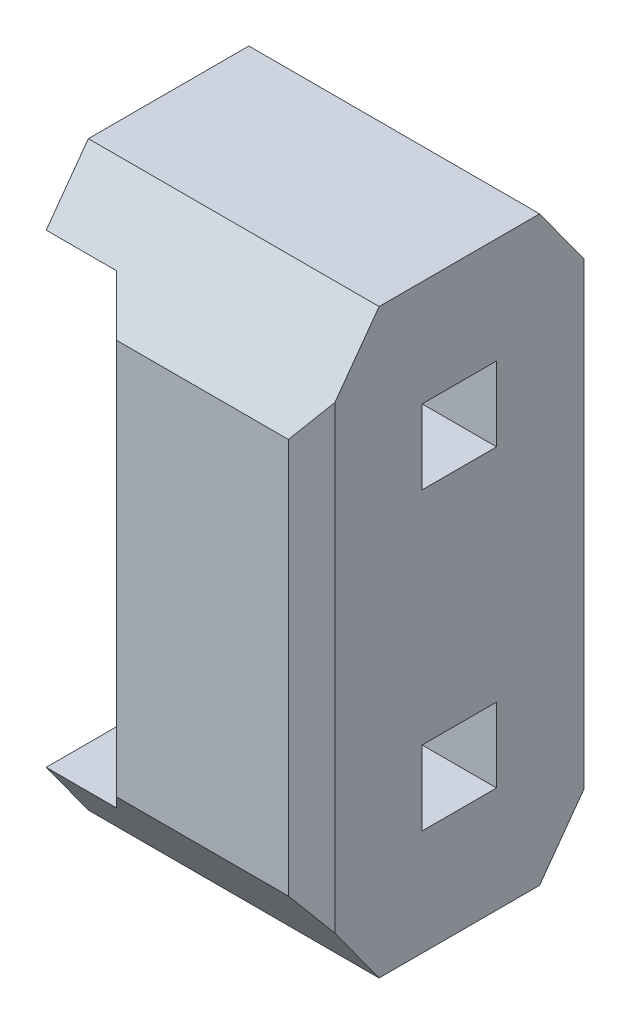
ISO-10303-21;
HEADER;
FILE_DESCRIPTION(('STEP AP214'),'2;1');
FILE_NAME('part.step','',(''),(''),'','','');
FILE_SCHEMA(('AUTOMOTIVE_DESIGN { 1 0 10303 214 1 1 1 1 }'));
ENDSEC;
DATA;
#1=APPLICATION_CONTEXT('core data for automotive mechanical design processes');
#2=APPLICATION_PROTOCOL_DEFINITION('international standard','automotive_design',2000,#1);
#3=PRODUCT_CONTEXT('',#1,'mechanical');
#4=PRODUCT('Part','Part','',(#3));
#5=PRODUCT_RELATED_PRODUCT_CATEGORY('part','',(#4));
#6=PRODUCT_DEFINITION_FORMATION('','',#4);
#7=PRODUCT_DEFINITION_CONTEXT('part definition',#1,'design');
#8=PRODUCT_DEFINITION('design','',#6,#7);
#9=PRODUCT_DEFINITION_SHAPE('','',#8);
#10=(LENGTH_UNIT() NAMED_UNIT(*) SI_UNIT(.MILLI.,.METRE.));
#11=(NAMED_UNIT(*) PLANE_ANGLE_UNIT() SI_UNIT($,.RADIAN.));
#12=(NAMED_UNIT(*) SI_UNIT($,.STERADIAN.) SOLID_ANGLE_UNIT());
#13=UNCERTAINTY_MEASURE_WITH_UNIT(LENGTH_MEASURE(1.E-05),#10,'distance_accuracy_value','');
#14=(GEOMETRIC_REPRESENTATION_CONTEXT(3) GLOBAL_UNCERTAINTY_ASSIGNED_CONTEXT((#13)) GLOBAL_UNIT_ASSIGNED_CONTEXT((#10,
#11,#12)) REPRESENTATION_CONTEXT('',''));
#15=CARTESIAN_POINT('',(0.,0.,0.));
#16=DIRECTION('',(0.,0.,1.));
#17=DIRECTION('',(1.,0.,0.));
#18=AXIS2_PLACEMENT_3D('',#15,#16,#17);
#19=CARTESIAN_POINT('',(1.25,4.6,-35.85));
#20=DIRECTION('',(0.,0.586967571460905,0.809610443394407));
#21=DIRECTION('',(0.,-0.809610443394407,0.586967571460905));
#22=AXIS2_PLACEMENT_3D('',#19,#20,#21);
#23=PLANE('',#22);
#24=DIRECTION('',(1.,0.,0.));
#25=VECTOR('',#24,1.);
#26=CARTESIAN_POINT('',(1.25,4.5,-35.7775));
#27=LINE('',#26,#25);
#28=CARTESIAN_POINT('',(0.,4.5,-35.7775));
#29=VERTEX_POINT('',#28);
#30=CARTESIAN_POINT('',(0.602500000000325,4.5,-35.7775000000001));
#31=VERTEX_POINT('',#30);
#32=EDGE_CURVE('E199',#29,#31,#27,.T.);
#33=ORIENTED_EDGE('',*,*,#32,.T.);
#34=DIRECTION('',(0.506207656348697,-0.698217457033984,0.506207656349602));
#35=VECTOR('',#34,1.);
#36=CARTESIAN_POINT('',(0.6025000000002,4.5,-35.7775));
#37=LINE('',#36,#35);
#38=CARTESIAN_POINT('',(0.819999999999671,4.2,-35.5599999999999));
#39=VERTEX_POINT('',#38);
#40=EDGE_CURVE('E197',#31,#39,#37,.T.);
#41=ORIENTED_EDGE('',*,*,#40,.T.);
#42=DIRECTION('',(1.,0.,0.));
#43=VECTOR('',#42,1.);
#44=CARTESIAN_POINT('',(1.25,4.19999999999999,-35.56));
#45=LINE('',#44,#43);
#46=CARTESIAN_POINT('',(2.30000000000012,4.2,-35.5599999999999));
#47=VERTEX_POINT('',#46);
#48=EDGE_CURVE('E20',#39,#47,#45,.T.);
#49=ORIENTED_EDGE('',*,*,#48,.T.);
#50=DIRECTION('',(0.506207656348957,0.698217457033858,-0.506207656349515));
#51=VECTOR('',#50,1.);
#52=CARTESIAN_POINT('',(2.3,4.19999999999999,-35.56));
#53=LINE('',#52,#51);
#54=CARTESIAN_POINT('',(2.49999999999988,4.47586206896592,-35.7600000000002));
#55=VERTEX_POINT('',#54);
#56=EDGE_CURVE('E181',#47,#55,#53,.T.);
#57=ORIENTED_EDGE('',*,*,#56,.T.);
#58=DIRECTION('',(0.,-0.809610443394407,0.586967571460905));
#59=VECTOR('',#58,1.);
#60=CARTESIAN_POINT('',(2.5,4.6,-35.85));
#61=LINE('',#60,#59);
#62=CARTESIAN_POINT('',(2.5,5.,-36.14));
#63=VERTEX_POINT('',#62);
#64=EDGE_CURVE('E188',#55,#63,#61,.F.);
#65=ORIENTED_EDGE('',*,*,#64,.T.);
#66=DIRECTION('',(1.,0.,0.));
#67=VECTOR('',#66,1.);
#68=CARTESIAN_POINT('',(1.25,5.,-36.14));
#69=LINE('',#68,#67);
#70=CARTESIAN_POINT('',(0.,5.,-36.14));
#71=VERTEX_POINT('',#70);
#72=EDGE_CURVE('E215',#71,#63,#69,.T.);
#73=ORIENTED_EDGE('',*,*,#72,.F.);
#74=DIRECTION('',(0.,-0.809610443394407,0.586967571460905));
#75=VECTOR('',#74,1.);
#76=CARTESIAN_POINT('',(0.,4.6,-35.85));
#77=LINE('',#76,#75);
#78=EDGE_CURVE('E207',#71,#29,#77,.T.);
#79=ORIENTED_EDGE('',*,*,#78,.T.);
#80=EDGE_LOOP('',(#33,#41,#49,#57,#65,#73,#79));
#81=FACE_BOUND('',#80,.T.);
#82=ADVANCED_FACE('F17',(#81),#23,.T.);
#83=CARTESIAN_POINT('',(1.25,4.6,-37.81));
#84=DIRECTION('',(0.,-0.586967571460905,0.809610443394407));
#85=DIRECTION('',(0.,-0.809610443394407,-0.586967571460905));
#86=AXIS2_PLACEMENT_3D('',#83,#84,#85);
#87=PLANE('',#86);
#88=DIRECTION('',(0.,-0.809610443394407,-0.586967571460905));
#89=VECTOR('',#88,1.);
#90=CARTESIAN_POINT('',(0.,4.6,-37.81));
#91=LINE('',#90,#89);
#92=CARTESIAN_POINT('',(0.,5.,-37.52));
#93=VERTEX_POINT('',#92);
#94=CARTESIAN_POINT('',(0.,4.5,-37.8825));
#95=VERTEX_POINT('',#94);
#96=EDGE_CURVE('E263',#93,#95,#91,.T.);
#97=ORIENTED_EDGE('',*,*,#96,.F.);
#98=DIRECTION('',(1.,0.,0.));
#99=VECTOR('',#98,1.);
#100=CARTESIAN_POINT('',(1.25,5.,-37.52));
#101=LINE('',#100,#99);
#102=CARTESIAN_POINT('',(2.5,5.,-37.52));
#103=VERTEX_POINT('',#102);
#104=EDGE_CURVE('E227',#103,#93,#101,.F.);
#105=ORIENTED_EDGE('',*,*,#104,.F.);
#106=DIRECTION('',(0.,-0.809610443394407,-0.586967571460905));
#107=VECTOR('',#106,1.);
#108=CARTESIAN_POINT('',(2.5,4.6,-37.81));
#109=LINE('',#108,#107);
#110=CARTESIAN_POINT('',(2.49999999999988,4.47586206896592,-37.8999999999998));
#111=VERTEX_POINT('',#110);
#112=EDGE_CURVE('E223',#111,#103,#109,.F.);
#113=ORIENTED_EDGE('',*,*,#112,.F.);
#114=DIRECTION('',(0.506207656348954,0.698217457033861,0.506207656349513));
#115=VECTOR('',#114,1.);
#116=CARTESIAN_POINT('',(2.3,4.19999999999999,-38.1));
#117=LINE('',#116,#115);
#118=CARTESIAN_POINT('',(2.30000000000012,4.2,-38.1000000000001));
#119=VERTEX_POINT('',#118);
#120=EDGE_CURVE('E266',#119,#111,#117,.T.);
#121=ORIENTED_EDGE('',*,*,#120,.F.);
#122=DIRECTION('',(1.,0.,0.));
#123=VECTOR('',#122,1.);
#124=CARTESIAN_POINT('',(1.25,4.19999999999999,-38.1));
#125=LINE('',#124,#123);
#126=CARTESIAN_POINT('',(0.819999999999671,4.2,-38.1000000000001));
#127=VERTEX_POINT('',#126);
#128=EDGE_CURVE('E205',#127,#119,#125,.T.);
#129=ORIENTED_EDGE('',*,*,#128,.F.);
#130=DIRECTION('',(0.506207656348697,-0.698217457033984,-0.506207656349602));
#131=VECTOR('',#130,1.);
#132=CARTESIAN_POINT('',(0.6025000000002,4.5,-37.8825));
#133=LINE('',#132,#131);
#134=CARTESIAN_POINT('',(0.602500000000324,4.5,-37.8824999999999));
#135=VERTEX_POINT('',#134);
#136=EDGE_CURVE('E203',#135,#127,#133,.T.);
#137=ORIENTED_EDGE('',*,*,#136,.F.);
#138=DIRECTION('',(1.,0.,0.));
#139=VECTOR('',#138,1.);
#140=CARTESIAN_POINT('',(1.25,4.5,-37.8825));
#141=LINE('',#140,#139);
#142=EDGE_CURVE('E261',#95,#135,#141,.T.);
#143=ORIENTED_EDGE('',*,*,#142,.F.);
#144=EDGE_LOOP('',(#97,#105,#113,#121,#129,#137,#143));
#145=FACE_BOUND('',#144,.T.);
#146=ADVANCED_FACE('F285',(#145),#87,.F.);
#147=CARTESIAN_POINT('',(1.25,0.4,-37.81));
#148=DIRECTION('',(0.,0.586967571460905,0.809610443394407));
#149=DIRECTION('',(0.,-0.809610443394407,0.586967571460905));
#150=AXIS2_PLACEMENT_3D('',#147,#148,#149);
#151=PLANE('',#150);
#152=DIRECTION('',(-0.5062076563494,0.698217457033649,-0.506207656349361));
#153=VECTOR('',#152,1.);
#154=CARTESIAN_POINT('',(2.5,0.524137931034493,-37.9));
#155=LINE('',#154,#153);
#156=CARTESIAN_POINT('',(2.49999999999988,0.524137931034496,-37.8999999999999));
#157=VERTEX_POINT('',#156);
#158=CARTESIAN_POINT('',(2.30000000000012,0.800000000000004,-38.1000000000001));
#159=VERTEX_POINT('',#158);
#160=EDGE_CURVE('E251',#157,#159,#155,.T.);
#161=ORIENTED_EDGE('',*,*,#160,.F.);
#162=DIRECTION('',(0.,-0.809610443394407,0.586967571460905));
#163=VECTOR('',#162,1.);
#164=CARTESIAN_POINT('',(2.5,0.4,-37.81));
#165=LINE('',#164,#163);
#166=CARTESIAN_POINT('',(2.5,0.,-37.52));
#167=VERTEX_POINT('',#166);
#168=EDGE_CURVE('E253',#167,#157,#165,.F.);
#169=ORIENTED_EDGE('',*,*,#168,.F.);
#170=DIRECTION('',(1.,0.,0.));
#171=VECTOR('',#170,1.);
#172=CARTESIAN_POINT('',(1.25,0.,-37.52));
#173=LINE('',#172,#171);
#174=CARTESIAN_POINT('',(0.,0.,-37.52));
#175=VERTEX_POINT('',#174);
#176=EDGE_CURVE('E288',#167,#175,#173,.F.);
#177=ORIENTED_EDGE('',*,*,#176,.T.);
#178=DIRECTION('',(0.,-0.809610443394407,0.586967571460905));
#179=VECTOR('',#178,1.);
#180=CARTESIAN_POINT('',(0.,0.4,-37.81));
#181=LINE('',#180,#179);
#182=CARTESIAN_POINT('',(0.,0.5,-37.8825));
#183=VERTEX_POINT('',#182);
#184=EDGE_CURVE('E255',#183,#175,#181,.T.);
#185=ORIENTED_EDGE('',*,*,#184,.F.);
#186=DIRECTION('',(1.,0.,0.));
#187=VECTOR('',#186,1.);
#188=CARTESIAN_POINT('',(1.25,0.500000000000001,-37.8825));
#189=LINE('',#188,#187);
#190=CARTESIAN_POINT('',(0.602500000000324,0.5,-37.8824999999999));
#191=VERTEX_POINT('',#190);
#192=EDGE_CURVE('E257',#191,#183,#189,.F.);
#193=ORIENTED_EDGE('',*,*,#192,.F.);
#194=DIRECTION('',(-0.506207656348696,-0.698217457033985,0.506207656349601));
#195=VECTOR('',#194,1.);
#196=CARTESIAN_POINT('',(0.8199999999998,0.800000000000008,-38.1));
#197=LINE('',#196,#195);
#198=CARTESIAN_POINT('',(0.819999999999671,0.800000000000004,-38.1000000000001));
#199=VERTEX_POINT('',#198);
#200=EDGE_CURVE('E259',#199,#191,#197,.T.);
#201=ORIENTED_EDGE('',*,*,#200,.F.);
#202=DIRECTION('',(1.,0.,0.));
#203=VECTOR('',#202,1.);
#204=CARTESIAN_POINT('',(1.25,0.800000000000008,-38.1));
#205=LINE('',#204,#203);
#206=EDGE_CURVE('E249',#159,#199,#205,.F.);
#207=ORIENTED_EDGE('',*,*,#206,.F.);
#208=EDGE_LOOP('',(#161,#169,#177,#185,#193,#201,#207));
#209=FACE_BOUND('',#208,.T.);
#210=ADVANCED_FACE('F431',(#209),#151,.F.);
#211=CARTESIAN_POINT('',(1.25,0.4,-35.85));
#212=DIRECTION('',(0.,-0.586967571460905,0.809610443394407));
#213=DIRECTION('',(0.,-0.809610443394407,-0.586967571460905));
#214=AXIS2_PLACEMENT_3D('',#211,#212,#213);
#215=PLANE('',#214);
#216=DIRECTION('',(1.,0.,0.));
#217=VECTOR('',#216,1.);
#218=CARTESIAN_POINT('',(1.25,0.800000000000008,-35.56));
#219=LINE('',#218,#217);
#220=CARTESIAN_POINT('',(2.30000000000012,0.800000000000004,-35.5599999999999));
#221=VERTEX_POINT('',#220);
#222=CARTESIAN_POINT('',(0.819999999999671,0.800000000000004,-35.5599999999999));
#223=VERTEX_POINT('',#222);
#224=EDGE_CURVE('E191',#221,#223,#219,.F.);
#225=ORIENTED_EDGE('',*,*,#224,.T.);
#226=DIRECTION('',(-0.506207656348696,-0.698217457033985,-0.506207656349601));
#227=VECTOR('',#226,1.);
#228=CARTESIAN_POINT('',(0.8199999999998,0.800000000000008,-35.56));
#229=LINE('',#228,#227);
#230=CARTESIAN_POINT('',(0.602500000000324,0.5,-35.7775000000001));
#231=VERTEX_POINT('',#230);
#232=EDGE_CURVE('E232',#223,#231,#229,.T.);
#233=ORIENTED_EDGE('',*,*,#232,.T.);
#234=DIRECTION('',(1.,0.,0.));
#235=VECTOR('',#234,1.);
#236=CARTESIAN_POINT('',(1.25,0.500000000000001,-35.7775));
#237=LINE('',#236,#235);
#238=CARTESIAN_POINT('',(0.,0.5,-35.7775));
#239=VERTEX_POINT('',#238);
#240=EDGE_CURVE('E246',#231,#239,#237,.F.);
#241=ORIENTED_EDGE('',*,*,#240,.T.);
#242=DIRECTION('',(0.,-0.809610443394407,-0.586967571460905));
#243=VECTOR('',#242,1.);
#244=CARTESIAN_POINT('',(0.,0.4,-35.85));
#245=LINE('',#244,#243);
#246=CARTESIAN_POINT('',(0.,0.,-36.14));
#247=VERTEX_POINT('',#246);
#248=EDGE_CURVE('E244',#239,#247,#245,.T.);
#249=ORIENTED_EDGE('',*,*,#248,.T.);
#250=DIRECTION('',(1.,0.,0.));
#251=VECTOR('',#250,1.);
#252=CARTESIAN_POINT('',(1.25,0.,-36.14));
#253=LINE('',#252,#251);
#254=CARTESIAN_POINT('',(2.5,0.,-36.14));
#255=VERTEX_POINT('',#254);
#256=EDGE_CURVE('E293',#247,#255,#253,.T.);
#257=ORIENTED_EDGE('',*,*,#256,.T.);
#258=DIRECTION('',(0.,-0.809610443394407,-0.586967571460905));
#259=VECTOR('',#258,1.);
#260=CARTESIAN_POINT('',(2.5,0.4,-35.85));
#261=LINE('',#260,#259);
#262=CARTESIAN_POINT('',(2.49999999999988,0.524137931034499,-35.7600000000001));
#263=VERTEX_POINT('',#262);
#264=EDGE_CURVE('E241',#255,#263,#261,.F.);
#265=ORIENTED_EDGE('',*,*,#264,.T.);
#266=DIRECTION('',(-0.506207656349409,0.698217457033648,0.506207656349353));
#267=VECTOR('',#266,1.);
#268=CARTESIAN_POINT('',(2.5,0.524137931034498,-35.76));
#269=LINE('',#268,#267);
#270=EDGE_CURVE('E239',#263,#221,#269,.T.);
#271=ORIENTED_EDGE('',*,*,#270,.T.);
#272=EDGE_LOOP('',(#225,#233,#241,#249,#257,#265,#271));
#273=FACE_BOUND('',#272,.T.);
#274=ADVANCED_FACE('F421',(#273),#215,.T.);
#275=CARTESIAN_POINT('',(1.25,5.,-36.83));
#276=DIRECTION('',(0.,1.,0.));
#277=DIRECTION('',(0.,0.,1.));
#278=AXIS2_PLACEMENT_3D('',#275,#276,#277);
#279=PLANE('',#278);
#280=ORIENTED_EDGE('',*,*,#104,.T.);
#281=DIRECTION('',(0.,0.,-1.));
#282=VECTOR('',#281,1.);
#283=CARTESIAN_POINT('',(0.,5.,-36.83));
#284=LINE('',#283,#282);
#285=EDGE_CURVE('E231',#93,#71,#284,.F.);
#286=ORIENTED_EDGE('',*,*,#285,.T.);
#287=ORIENTED_EDGE('',*,*,#72,.T.);
#288=DIRECTION('',(0.,0.,1.));
#289=VECTOR('',#288,1.);
#290=CARTESIAN_POINT('',(2.5,5.,-36.83));
#291=LINE('',#290,#289);
#292=EDGE_CURVE('E219',#63,#103,#291,.F.);
#293=ORIENTED_EDGE('',*,*,#292,.T.);
#294=EDGE_LOOP('',(#280,#286,#287,#293));
#295=FACE_BOUND('',#294,.T.);
#296=ADVANCED_FACE('F229',(#295),#279,.T.);
#297=CARTESIAN_POINT('',(1.25,0.,-36.83));
#298=DIRECTION('',(0.,1.,0.));
#299=DIRECTION('',(0.,0.,1.));
#300=AXIS2_PLACEMENT_3D('',#297,#298,#299);
#301=PLANE('',#300);
#302=DIRECTION('',(0.,0.,-1.));
#303=VECTOR('',#302,1.);
#304=CARTESIAN_POINT('',(0.,0.,-36.83));
#305=LINE('',#304,#303);
#306=EDGE_CURVE('E297',#247,#175,#305,.T.);
#307=ORIENTED_EDGE('',*,*,#306,.T.);
#308=ORIENTED_EDGE('',*,*,#176,.F.);
#309=DIRECTION('',(0.,0.,1.));
#310=VECTOR('',#309,1.);
#311=CARTESIAN_POINT('',(2.5,0.,-36.83));
#312=LINE('',#311,#310);
#313=EDGE_CURVE('E287',#255,#167,#312,.F.);
#314=ORIENTED_EDGE('',*,*,#313,.F.);
#315=ORIENTED_EDGE('',*,*,#256,.F.);
#316=EDGE_LOOP('',(#307,#308,#314,#315));
#317=FACE_BOUND('',#316,.T.);
#318=ADVANCED_FACE('F428',(#317),#301,.F.);
#319=CARTESIAN_POINT('',(0.,4.75,-36.83));
#320=DIRECTION('',(1.,0.,0.));
#321=DIRECTION('',(0.,0.,-1.));
#322=AXIS2_PLACEMENT_3D('',#319,#320,#321);
#323=PLANE('',#322);
#324=ORIENTED_EDGE('',*,*,#285,.F.);
#325=ORIENTED_EDGE('',*,*,#96,.T.);
#326=DIRECTION('',(0.,0.,1.));
#327=VECTOR('',#326,1.);
#328=CARTESIAN_POINT('',(0.,4.5,-36.83));
#329=LINE('',#328,#327);
#330=EDGE_CURVE('E307',#95,#29,#329,.T.);
#331=ORIENTED_EDGE('',*,*,#330,.T.);
#332=ORIENTED_EDGE('',*,*,#78,.F.);
#333=EDGE_LOOP('',(#324,#325,#331,#332));
#334=FACE_BOUND('',#333,.T.);
#335=ADVANCED_FACE('F441',(#334),#323,.F.);
#336=CARTESIAN_POINT('',(0.,0.25,-36.83));
#337=DIRECTION('',(1.,0.,0.));
#338=DIRECTION('',(0.,0.,-1.));
#339=AXIS2_PLACEMENT_3D('',#336,#337,#338);
#340=PLANE('',#339);
#341=ORIENTED_EDGE('',*,*,#306,.F.);
#342=ORIENTED_EDGE('',*,*,#248,.F.);
#343=DIRECTION('',(0.,0.,1.));
#344=VECTOR('',#343,1.);
#345=CARTESIAN_POINT('',(0.,0.5,-36.83));
#346=LINE('',#345,#344);
#347=EDGE_CURVE('E315',#183,#239,#346,.T.);
#348=ORIENTED_EDGE('',*,*,#347,.F.);
#349=ORIENTED_EDGE('',*,*,#184,.T.);
#350=EDGE_LOOP('',(#341,#342,#348,#349));
#351=FACE_BOUND('',#350,.T.);
#352=ADVANCED_FACE('F443',(#351),#340,.F.);
#353=CARTESIAN_POINT('',(1.55,3.45,-36.83));
#354=DIRECTION('',(0.,1.,0.));
#355=DIRECTION('',(0.,0.,1.));
#356=AXIS2_PLACEMENT_3D('',#353,#354,#355);
#357=PLANE('',#356);
#358=DIRECTION('',(1.,0.,0.));
#359=VECTOR('',#358,1.);
#360=CARTESIAN_POINT('',(1.55,3.45,-37.15));
#361=LINE('',#360,#359);
#362=CARTESIAN_POINT('',(0.6,3.45,-37.15));
#363=VERTEX_POINT('',#362);
#364=CARTESIAN_POINT('',(2.5,3.45,-37.15));
#365=VERTEX_POINT('',#364);
#366=EDGE_CURVE('E332',#363,#365,#361,.T.);
#367=ORIENTED_EDGE('',*,*,#366,.F.);
#368=DIRECTION('',(0.,0.,1.));
#369=VECTOR('',#368,1.);
#370=CARTESIAN_POINT('',(0.6,3.45,-36.83));
#371=LINE('',#370,#369);
#372=CARTESIAN_POINT('',(0.6,3.45,-36.51));
#373=VERTEX_POINT('',#372);
#374=EDGE_CURVE('E302',#363,#373,#371,.T.);
#375=ORIENTED_EDGE('',*,*,#374,.T.);
#376=DIRECTION('',(1.,0.,0.));
#377=VECTOR('',#376,1.);
#378=CARTESIAN_POINT('',(1.55,3.45,-36.51));
#379=LINE('',#378,#377);
#380=CARTESIAN_POINT('',(2.5,3.45,-36.51));
#381=VERTEX_POINT('',#380);
#382=EDGE_CURVE('E327',#373,#381,#379,.T.);
#383=ORIENTED_EDGE('',*,*,#382,.T.);
#384=DIRECTION('',(0.,0.,1.));
#385=VECTOR('',#384,1.);
#386=CARTESIAN_POINT('',(2.5,3.45,-36.83));
#387=LINE('',#386,#385);
#388=EDGE_CURVE('E300',#381,#365,#387,.F.);
#389=ORIENTED_EDGE('',*,*,#388,.T.);
#390=EDGE_LOOP('',(#367,#375,#383,#389));
#391=FACE_BOUND('',#390,.T.);
#392=ADVANCED_FACE('F398',(#391),#357,.T.);
#393=CARTESIAN_POINT('',(0.71,2.5,-37.99));
#394=DIRECTION('',(0.707106781190498,0.,0.707106781182598));
#395=DIRECTION('',(0.707106781182598,0.,-0.707106781190498));
#396=AXIS2_PLACEMENT_3D('',#393,#394,#395);
#397=PLANE('',#396);
#398=ORIENTED_EDGE('',*,*,#200,.T.);
#399=DIRECTION('',(0.707106781187161,0.,-0.707106781185934));
#400=VECTOR('',#399,1.);
#401=CARTESIAN_POINT('',(0.6000000000002,0.5,-37.88));
#402=LINE('',#401,#400);
#403=CARTESIAN_POINT('',(0.600000000000408,0.5,-37.8799999999997));
#404=VERTEX_POINT('',#403);
#405=EDGE_CURVE('E312',#404,#191,#402,.T.);
#406=ORIENTED_EDGE('',*,*,#405,.F.);
#407=DIRECTION('',(0.,1.,0.));
#408=VECTOR('',#407,1.);
#409=CARTESIAN_POINT('',(0.6,2.5,-37.88));
#410=LINE('',#409,#408);
#411=CARTESIAN_POINT('',(0.600000000000408,4.5,-37.8799999999997));
#412=VERTEX_POINT('',#411);
#413=EDGE_CURVE('E337',#404,#412,#410,.T.);
#414=ORIENTED_EDGE('',*,*,#413,.T.);
#415=DIRECTION('',(0.707106781187161,0.,-0.707106781185934));
#416=VECTOR('',#415,1.);
#417=CARTESIAN_POINT('',(0.6000000000002,4.5,-37.88));
#418=LINE('',#417,#416);
#419=EDGE_CURVE('E304',#412,#135,#418,.T.);
#420=ORIENTED_EDGE('',*,*,#419,.T.);
#421=ORIENTED_EDGE('',*,*,#136,.T.);
#422=DIRECTION('',(0.,1.,0.));
#423=VECTOR('',#422,1.);
#424=CARTESIAN_POINT('',(0.8199999999998,2.5,-38.1));
#425=LINE('',#424,#423);
#426=EDGE_CURVE('E275',#127,#199,#425,.F.);
#427=ORIENTED_EDGE('',*,*,#426,.T.);
#428=EDGE_LOOP('',(#398,#406,#414,#420,#421,#427));
#429=FACE_BOUND('',#428,.T.);
#430=ADVANCED_FACE('F435',(#429),#397,.F.);
#431=CARTESIAN_POINT('',(0.30125,4.5,-36.83));
#432=DIRECTION('',(0.,1.,0.));
#433=DIRECTION('',(0.,0.,1.));
#434=AXIS2_PLACEMENT_3D('',#431,#432,#433);
#435=PLANE('',#434);
#436=ORIENTED_EDGE('',*,*,#142,.T.);
#437=ORIENTED_EDGE('',*,*,#419,.F.);
#438=DIRECTION('',(0.,0.,-1.));
#439=VECTOR('',#438,1.);
#440=CARTESIAN_POINT('',(0.6,4.5,-36.83));
#441=LINE('',#440,#439);
#442=CARTESIAN_POINT('',(0.600000000000279,4.5,-35.7800000000001));
#443=VERTEX_POINT('',#442);
#444=EDGE_CURVE('E339',#412,#443,#441,.F.);
#445=ORIENTED_EDGE('',*,*,#444,.T.);
#446=DIRECTION('',(-0.707106781182598,0.,-0.707106781190498));
#447=VECTOR('',#446,1.);
#448=CARTESIAN_POINT('',(0.71,4.5,-35.67));
#449=LINE('',#448,#447);
#450=EDGE_CURVE('E310',#443,#31,#449,.F.);
#451=ORIENTED_EDGE('',*,*,#450,.T.);
#452=ORIENTED_EDGE('',*,*,#32,.F.);
#453=ORIENTED_EDGE('',*,*,#330,.F.);
#454=EDGE_LOOP('',(#436,#437,#445,#451,#452,#453));
#455=FACE_BOUND('',#454,.T.);
#456=ADVANCED_FACE('F439',(#455),#435,.F.);
#457=CARTESIAN_POINT('',(0.71,2.5,-35.67));
#458=DIRECTION('',(0.707106781190498,0.,-0.707106781182598));
#459=DIRECTION('',(-0.707106781182598,0.,-0.707106781190498));
#460=AXIS2_PLACEMENT_3D('',#457,#458,#459);
#461=PLANE('',#460);
#462=ORIENTED_EDGE('',*,*,#232,.F.);
#463=DIRECTION('',(0.,1.,0.));
#464=VECTOR('',#463,1.);
#465=CARTESIAN_POINT('',(0.8199999999998,2.5,-35.56));
#466=LINE('',#465,#464);
#467=EDGE_CURVE('E325',#39,#223,#466,.F.);
#468=ORIENTED_EDGE('',*,*,#467,.F.);
#469=ORIENTED_EDGE('',*,*,#40,.F.);
#470=ORIENTED_EDGE('',*,*,#450,.F.);
#471=DIRECTION('',(0.,1.,0.));
#472=VECTOR('',#471,1.);
#473=CARTESIAN_POINT('',(0.6,2.5,-35.78));
#474=LINE('',#473,#472);
#475=CARTESIAN_POINT('',(0.600000000000408,0.5,-35.7800000000003));
#476=VERTEX_POINT('',#475);
#477=EDGE_CURVE('E341',#443,#476,#474,.F.);
#478=ORIENTED_EDGE('',*,*,#477,.T.);
#479=DIRECTION('',(-0.707106781187161,0.,-0.707106781185934));
#480=VECTOR('',#479,1.);
#481=CARTESIAN_POINT('',(0.6025000000002,0.5,-35.7775));
#482=LINE('',#481,#480);
#483=EDGE_CURVE('E318',#231,#476,#482,.T.);
#484=ORIENTED_EDGE('',*,*,#483,.F.);
#485=EDGE_LOOP('',(#462,#468,#469,#470,#478,#484));
#486=FACE_BOUND('',#485,.T.);
#487=ADVANCED_FACE('F416',(#486),#461,.F.);
#488=CARTESIAN_POINT('',(0.30125,0.5,-36.83));
#489=DIRECTION('',(0.,1.,0.));
#490=DIRECTION('',(0.,0.,1.));
#491=AXIS2_PLACEMENT_3D('',#488,#489,#490);
#492=PLANE('',#491);
#493=ORIENTED_EDGE('',*,*,#483,.T.);
#494=DIRECTION('',(0.,0.,-1.));
#495=VECTOR('',#494,1.);
#496=CARTESIAN_POINT('',(0.6,0.5,-36.83));
#497=LINE('',#496,#495);
#498=EDGE_CURVE('E343',#476,#404,#497,.T.);
#499=ORIENTED_EDGE('',*,*,#498,.T.);
#500=ORIENTED_EDGE('',*,*,#405,.T.);
#501=ORIENTED_EDGE('',*,*,#192,.T.);
#502=ORIENTED_EDGE('',*,*,#347,.T.);
#503=ORIENTED_EDGE('',*,*,#240,.F.);
#504=EDGE_LOOP('',(#493,#499,#500,#501,#502,#503));
#505=FACE_BOUND('',#504,.T.);
#506=ADVANCED_FACE('F418',(#505),#492,.T.);
#507=CARTESIAN_POINT('',(1.55,1.23,-37.15));
#508=DIRECTION('',(0.,0.,1.));
#509=DIRECTION('',(1.,0.,0.));
#510=AXIS2_PLACEMENT_3D('',#507,#508,#509);
#511=PLANE('',#510);
#512=DIRECTION('',(1.,0.,0.));
#513=VECTOR('',#512,1.);
#514=CARTESIAN_POINT('',(1.55,1.55,-37.15));
#515=LINE('',#514,#513);
#516=CARTESIAN_POINT('',(2.5,1.55,-37.15));
#517=VERTEX_POINT('',#516);
#518=CARTESIAN_POINT('',(0.6,1.55,-37.15));
#519=VERTEX_POINT('',#518);
#520=EDGE_CURVE('E283',#517,#519,#515,.F.);
#521=ORIENTED_EDGE('',*,*,#520,.T.);
#522=DIRECTION('',(0.,1.,0.));
#523=VECTOR('',#522,1.);
#524=CARTESIAN_POINT('',(0.6,2.5,-37.15));
#525=LINE('',#524,#523);
#526=CARTESIAN_POINT('',(0.6,0.91,-37.15));
#527=VERTEX_POINT('',#526);
#528=EDGE_CURVE('E346',#519,#527,#525,.F.);
#529=ORIENTED_EDGE('',*,*,#528,.T.);
#530=DIRECTION('',(1.,0.,0.));
#531=VECTOR('',#530,1.);
#532=CARTESIAN_POINT('',(1.55,0.91,-37.15));
#533=LINE('',#532,#531);
#534=CARTESIAN_POINT('',(2.5,0.91,-37.15));
#535=VERTEX_POINT('',#534);
#536=EDGE_CURVE('E354',#535,#527,#533,.F.);
#537=ORIENTED_EDGE('',*,*,#536,.F.);
#538=DIRECTION('',(0.,1.,0.));
#539=VECTOR('',#538,1.);
#540=CARTESIAN_POINT('',(2.5,1.23,-37.15));
#541=LINE('',#540,#539);
#542=EDGE_CURVE('E321',#535,#517,#541,.T.);
#543=ORIENTED_EDGE('',*,*,#542,.T.);
#544=EDGE_LOOP('',(#521,#529,#537,#543));
#545=FACE_BOUND('',#544,.T.);
#546=ADVANCED_FACE('F483',(#545),#511,.T.);
#547=CARTESIAN_POINT('',(1.56,2.5,-38.1));
#548=DIRECTION('',(0.,0.,1.));
#549=DIRECTION('',(1.,0.,0.));
#550=AXIS2_PLACEMENT_3D('',#547,#548,#549);
#551=PLANE('',#550);
#552=DIRECTION('',(0.,1.,0.));
#553=VECTOR('',#552,1.);
#554=CARTESIAN_POINT('',(2.30000000000047,2.5,-38.1000000000005));
#555=LINE('',#554,#553);
#556=EDGE_CURVE('E193',#159,#119,#555,.T.);
#557=ORIENTED_EDGE('',*,*,#556,.F.);
#558=ORIENTED_EDGE('',*,*,#206,.T.);
#559=ORIENTED_EDGE('',*,*,#426,.F.);
#560=ORIENTED_EDGE('',*,*,#128,.T.);
#561=EDGE_LOOP('',(#557,#558,#559,#560));
#562=FACE_BOUND('',#561,.T.);
#563=ADVANCED_FACE('F272',(#562),#551,.F.);
#564=CARTESIAN_POINT('',(1.56,2.5,-35.56));
#565=DIRECTION('',(0.,0.,1.));
#566=DIRECTION('',(1.,0.,0.));
#567=AXIS2_PLACEMENT_3D('',#564,#565,#566);
#568=PLANE('',#567);
#569=ORIENTED_EDGE('',*,*,#48,.F.);
#570=ORIENTED_EDGE('',*,*,#467,.T.);
#571=ORIENTED_EDGE('',*,*,#224,.F.);
#572=DIRECTION('',(0.,1.,0.));
#573=VECTOR('',#572,1.);
#574=CARTESIAN_POINT('',(2.30000000000047,2.5,-35.5599999999995));
#575=LINE('',#574,#573);
#576=EDGE_CURVE('E183',#47,#221,#575,.F.);
#577=ORIENTED_EDGE('',*,*,#576,.F.);
#578=EDGE_LOOP('',(#569,#570,#571,#577));
#579=FACE_BOUND('',#578,.T.);
#580=ADVANCED_FACE('F189',(#579),#568,.T.);
#581=CARTESIAN_POINT('',(1.55,3.77,-36.51));
#582=DIRECTION('',(0.,0.,1.));
#583=DIRECTION('',(1.,0.,0.));
#584=AXIS2_PLACEMENT_3D('',#581,#582,#583);
#585=PLANE('',#584);
#586=DIRECTION('',(0.,1.,0.));
#587=VECTOR('',#586,1.);
#588=CARTESIAN_POINT('',(2.5,3.77,-36.51));
#589=LINE('',#588,#587);
#590=CARTESIAN_POINT('',(2.5,4.09,-36.51));
#591=VERTEX_POINT('',#590);
#592=EDGE_CURVE('E330',#381,#591,#589,.T.);
#593=ORIENTED_EDGE('',*,*,#592,.F.);
#594=ORIENTED_EDGE('',*,*,#382,.F.);
#595=DIRECTION('',(0.,1.,0.));
#596=VECTOR('',#595,1.);
#597=CARTESIAN_POINT('',(0.6,2.5,-36.51));
#598=LINE('',#597,#596);
#599=CARTESIAN_POINT('',(0.6,4.09,-36.51));
#600=VERTEX_POINT('',#599);
#601=EDGE_CURVE('E351',#373,#600,#598,.T.);
#602=ORIENTED_EDGE('',*,*,#601,.T.);
#603=DIRECTION('',(1.,0.,0.));
#604=VECTOR('',#603,1.);
#605=CARTESIAN_POINT('',(1.55,4.09,-36.51));
#606=LINE('',#605,#604);
#607=EDGE_CURVE('E368',#600,#591,#606,.T.);
#608=ORIENTED_EDGE('',*,*,#607,.T.);
#609=EDGE_LOOP('',(#593,#594,#602,#608));
#610=FACE_BOUND('',#609,.T.);
#611=ADVANCED_FACE('F402',(#610),#585,.F.);
#612=CARTESIAN_POINT('',(1.55,3.77,-37.15));
#613=DIRECTION('',(0.,0.,1.));
#614=DIRECTION('',(1.,0.,0.));
#615=AXIS2_PLACEMENT_3D('',#612,#613,#614);
#616=PLANE('',#615);
#617=DIRECTION('',(1.,0.,0.));
#618=VECTOR('',#617,1.);
#619=CARTESIAN_POINT('',(1.55,4.09,-37.15));
#620=LINE('',#619,#618);
#621=CARTESIAN_POINT('',(2.5,4.09,-37.15));
#622=VERTEX_POINT('',#621);
#623=CARTESIAN_POINT('',(0.6,4.09,-37.15));
#624=VERTEX_POINT('',#623);
#625=EDGE_CURVE('E371',#622,#624,#620,.F.);
#626=ORIENTED_EDGE('',*,*,#625,.T.);
#627=DIRECTION('',(0.,1.,0.));
#628=VECTOR('',#627,1.);
#629=CARTESIAN_POINT('',(0.6,2.5,-37.15));
#630=LINE('',#629,#628);
#631=EDGE_CURVE('E348',#624,#363,#630,.F.);
#632=ORIENTED_EDGE('',*,*,#631,.T.);
#633=ORIENTED_EDGE('',*,*,#366,.T.);
#634=DIRECTION('',(0.,1.,0.));
#635=VECTOR('',#634,1.);
#636=CARTESIAN_POINT('',(2.5,3.77,-37.15));
#637=LINE('',#636,#635);
#638=EDGE_CURVE('E335',#365,#622,#637,.T.);
#639=ORIENTED_EDGE('',*,*,#638,.T.);
#640=EDGE_LOOP('',(#626,#632,#633,#639));
#641=FACE_BOUND('',#640,.T.);
#642=ADVANCED_FACE('F395',(#641),#616,.T.);
#643=CARTESIAN_POINT('',(0.6,2.5,-36.83));
#644=DIRECTION('',(1.,0.,0.));
#645=DIRECTION('',(0.,0.,-1.));
#646=AXIS2_PLACEMENT_3D('',#643,#644,#645);
#647=PLANE('',#646);
#648=ORIENTED_EDGE('',*,*,#374,.F.);
#649=ORIENTED_EDGE('',*,*,#631,.F.);
#650=DIRECTION('',(0.,0.,1.));
#651=VECTOR('',#650,1.);
#652=CARTESIAN_POINT('',(0.6,4.09,-36.83));
#653=LINE('',#652,#651);
#654=EDGE_CURVE('E192',#624,#600,#653,.T.);
#655=ORIENTED_EDGE('',*,*,#654,.T.);
#656=ORIENTED_EDGE('',*,*,#601,.F.);
#657=EDGE_LOOP('',(#648,#649,#655,#656));
#658=FACE_BOUND('',#657,.T.);
#659=ORIENTED_EDGE('',*,*,#528,.F.);
#660=DIRECTION('',(0.,0.,1.));
#661=VECTOR('',#660,1.);
#662=CARTESIAN_POINT('',(0.6,1.55,-36.83));
#663=LINE('',#662,#661);
#664=CARTESIAN_POINT('',(0.6,1.55,-36.51));
#665=VERTEX_POINT('',#664);
#666=EDGE_CURVE('E360',#519,#665,#663,.T.);
#667=ORIENTED_EDGE('',*,*,#666,.T.);
#668=DIRECTION('',(0.,1.,0.));
#669=VECTOR('',#668,1.);
#670=CARTESIAN_POINT('',(0.6,1.23,-36.51));
#671=LINE('',#670,#669);
#672=CARTESIAN_POINT('',(0.6,0.91,-36.51));
#673=VERTEX_POINT('',#672);
#674=EDGE_CURVE('E374',#665,#673,#671,.F.);
#675=ORIENTED_EDGE('',*,*,#674,.T.);
#676=DIRECTION('',(0.,0.,1.));
#677=VECTOR('',#676,1.);
#678=CARTESIAN_POINT('',(0.6,0.91,-36.83));
#679=LINE('',#678,#677);
#680=EDGE_CURVE('E357',#527,#673,#679,.T.);
#681=ORIENTED_EDGE('',*,*,#680,.F.);
#682=EDGE_LOOP('',(#659,#667,#675,#681));
#683=FACE_BOUND('',#682,.T.);
#684=ORIENTED_EDGE('',*,*,#477,.F.);
#685=ORIENTED_EDGE('',*,*,#444,.F.);
#686=ORIENTED_EDGE('',*,*,#413,.F.);
#687=ORIENTED_EDGE('',*,*,#498,.F.);
#688=EDGE_LOOP('',(#684,#685,#686,#687));
#689=FACE_BOUND('',#688,.T.);
#690=ADVANCED_FACE('F404',(#658,#683,#689),#647,.F.);
#691=CARTESIAN_POINT('',(1.55,0.91,-36.83));
#692=DIRECTION('',(0.,1.,0.));
#693=DIRECTION('',(0.,0.,1.));
#694=AXIS2_PLACEMENT_3D('',#691,#692,#693);
#695=PLANE('',#694);
#696=ORIENTED_EDGE('',*,*,#536,.T.);
#697=ORIENTED_EDGE('',*,*,#680,.T.);
#698=DIRECTION('',(1.,0.,0.));
#699=VECTOR('',#698,1.);
#700=CARTESIAN_POINT('',(1.55,0.91,-36.51));
#701=LINE('',#700,#699);
#702=CARTESIAN_POINT('',(2.5,0.91,-36.51));
#703=VERTEX_POINT('',#702);
#704=EDGE_CURVE('E376',#673,#703,#701,.T.);
#705=ORIENTED_EDGE('',*,*,#704,.T.);
#706=DIRECTION('',(0.,0.,1.));
#707=VECTOR('',#706,1.);
#708=CARTESIAN_POINT('',(2.5,0.91,-36.83));
#709=LINE('',#708,#707);
#710=EDGE_CURVE('E34',#703,#535,#709,.F.);
#711=ORIENTED_EDGE('',*,*,#710,.T.);
#712=EDGE_LOOP('',(#696,#697,#705,#711));
#713=FACE_BOUND('',#712,.T.);
#714=ADVANCED_FACE('F407',(#713),#695,.T.);
#715=CARTESIAN_POINT('',(1.55,1.55,-36.83));
#716=DIRECTION('',(0.,1.,0.));
#717=DIRECTION('',(0.,0.,1.));
#718=AXIS2_PLACEMENT_3D('',#715,#716,#717);
#719=PLANE('',#718);
#720=DIRECTION('',(0.,0.,1.));
#721=VECTOR('',#720,1.);
#722=CARTESIAN_POINT('',(2.5,1.55,-36.83));
#723=LINE('',#722,#721);
#724=CARTESIAN_POINT('',(2.5,1.55,-36.51));
#725=VERTEX_POINT('',#724);
#726=EDGE_CURVE('E362',#725,#517,#723,.F.);
#727=ORIENTED_EDGE('',*,*,#726,.F.);
#728=DIRECTION('',(1.,0.,0.));
#729=VECTOR('',#728,1.);
#730=CARTESIAN_POINT('',(1.55,1.55,-36.51));
#731=LINE('',#730,#729);
#732=EDGE_CURVE('E378',#725,#665,#731,.F.);
#733=ORIENTED_EDGE('',*,*,#732,.T.);
#734=ORIENTED_EDGE('',*,*,#666,.F.);
#735=ORIENTED_EDGE('',*,*,#520,.F.);
#736=EDGE_LOOP('',(#727,#733,#734,#735));
#737=FACE_BOUND('',#736,.T.);
#738=ADVANCED_FACE('F468',(#737),#719,.F.);
#739=CARTESIAN_POINT('',(2.4,2.5,-38.));
#740=DIRECTION('',(0.707106781189898,0.,-0.707106781183198));
#741=DIRECTION('',(-0.707106781183198,0.,-0.707106781189898));
#742=AXIS2_PLACEMENT_3D('',#739,#740,#741);
#743=PLANE('',#742);
#744=DIRECTION('',(0.,1.,0.));
#745=VECTOR('',#744,1.);
#746=CARTESIAN_POINT('',(2.5,2.5,-37.9));
#747=LINE('',#746,#745);
#748=EDGE_CURVE('E381',#157,#111,#747,.T.);
#749=ORIENTED_EDGE('',*,*,#748,.F.);
#750=ORIENTED_EDGE('',*,*,#160,.T.);
#751=ORIENTED_EDGE('',*,*,#556,.T.);
#752=ORIENTED_EDGE('',*,*,#120,.T.);
#753=EDGE_LOOP('',(#749,#750,#751,#752));
#754=FACE_BOUND('',#753,.T.);
#755=ADVANCED_FACE('F281',(#754),#743,.T.);
#756=CARTESIAN_POINT('',(2.4,2.5,-35.66));
#757=DIRECTION('',(0.707106781189898,0.,0.707106781183198));
#758=DIRECTION('',(0.707106781183198,0.,-0.707106781189898));
#759=AXIS2_PLACEMENT_3D('',#756,#757,#758);
#760=PLANE('',#759);
#761=DIRECTION('',(0.,1.,0.));
#762=VECTOR('',#761,1.);
#763=CARTESIAN_POINT('',(2.5,2.5,-35.76));
#764=LINE('',#763,#762);
#765=EDGE_CURVE('E186',#55,#263,#764,.F.);
#766=ORIENTED_EDGE('',*,*,#765,.F.);
#767=ORIENTED_EDGE('',*,*,#56,.F.);
#768=ORIENTED_EDGE('',*,*,#576,.T.);
#769=ORIENTED_EDGE('',*,*,#270,.F.);
#770=EDGE_LOOP('',(#766,#767,#768,#769));
#771=FACE_BOUND('',#770,.T.);
#772=ADVANCED_FACE('F182',(#771),#760,.T.);
#773=CARTESIAN_POINT('',(1.55,4.09,-36.83));
#774=DIRECTION('',(0.,1.,0.));
#775=DIRECTION('',(0.,0.,1.));
#776=AXIS2_PLACEMENT_3D('',#773,#774,#775);
#777=PLANE('',#776);
#778=DIRECTION('',(0.,0.,-1.));
#779=VECTOR('',#778,1.);
#780=CARTESIAN_POINT('',(2.5,4.09,-36.83));
#781=LINE('',#780,#779);
#782=EDGE_CURVE('E26',#591,#622,#781,.T.);
#783=ORIENTED_EDGE('',*,*,#782,.F.);
#784=ORIENTED_EDGE('',*,*,#607,.F.);
#785=ORIENTED_EDGE('',*,*,#654,.F.);
#786=ORIENTED_EDGE('',*,*,#625,.F.);
#787=EDGE_LOOP('',(#783,#784,#785,#786));
#788=FACE_BOUND('',#787,.T.);
#789=ADVANCED_FACE('F392',(#788),#777,.F.);
#790=CARTESIAN_POINT('',(1.55,1.23,-36.51));
#791=DIRECTION('',(0.,0.,1.));
#792=DIRECTION('',(1.,0.,0.));
#793=AXIS2_PLACEMENT_3D('',#790,#791,#792);
#794=PLANE('',#793);
#795=DIRECTION('',(0.,1.,0.));
#796=VECTOR('',#795,1.);
#797=CARTESIAN_POINT('',(2.5,2.5,-36.51));
#798=LINE('',#797,#796);
#799=EDGE_CURVE('E11',#703,#725,#798,.T.);
#800=ORIENTED_EDGE('',*,*,#799,.F.);
#801=ORIENTED_EDGE('',*,*,#704,.F.);
#802=ORIENTED_EDGE('',*,*,#674,.F.);
#803=ORIENTED_EDGE('',*,*,#732,.F.);
#804=EDGE_LOOP('',(#800,#801,#802,#803));
#805=FACE_BOUND('',#804,.T.);
#806=ADVANCED_FACE('F454',(#805),#794,.F.);
#807=CARTESIAN_POINT('',(2.5,2.5,-36.83));
#808=DIRECTION('',(1.,0.,0.));
#809=DIRECTION('',(0.,0.,-1.));
#810=AXIS2_PLACEMENT_3D('',#807,#808,#809);
#811=PLANE('',#810);
#812=ORIENTED_EDGE('',*,*,#710,.F.);
#813=ORIENTED_EDGE('',*,*,#799,.T.);
#814=ORIENTED_EDGE('',*,*,#726,.T.);
#815=ORIENTED_EDGE('',*,*,#542,.F.);
#816=EDGE_LOOP('',(#812,#813,#814,#815));
#817=FACE_BOUND('',#816,.T.);
#818=ORIENTED_EDGE('',*,*,#592,.T.);
#819=ORIENTED_EDGE('',*,*,#782,.T.);
#820=ORIENTED_EDGE('',*,*,#638,.F.);
#821=ORIENTED_EDGE('',*,*,#388,.F.);
#822=EDGE_LOOP('',(#818,#819,#820,#821));
#823=FACE_BOUND('',#822,.T.);
#824=ORIENTED_EDGE('',*,*,#64,.F.);
#825=ORIENTED_EDGE('',*,*,#765,.T.);
#826=ORIENTED_EDGE('',*,*,#264,.F.);
#827=ORIENTED_EDGE('',*,*,#313,.T.);
#828=ORIENTED_EDGE('',*,*,#168,.T.);
#829=ORIENTED_EDGE('',*,*,#748,.T.);
#830=ORIENTED_EDGE('',*,*,#112,.T.);
#831=ORIENTED_EDGE('',*,*,#292,.F.);
#832=EDGE_LOOP('',(#824,#825,#826,#827,#828,#829,#830,#831));
#833=FACE_BOUND('',#832,.T.);
#834=ADVANCED_FACE('F220',(#817,#823,#833),#811,.T.);
#835=CLOSED_SHELL('',(#82,#146,#210,#274,#296,#318,#335,#352,#392,#430,#456,#487,#506,#546,#563,
#580,#611,#642,#690,#714,#738,#755,#772,#789,#806,#834));
#836=MANIFOLD_SOLID_BREP('B1',#835);
#837=ADVANCED_BREP_SHAPE_REPRESENTATION('',(#18,#836),#14);
#838=SHAPE_DEFINITION_REPRESENTATION(#9,#837);
ENDSEC;
END-ISO-10303-21;
